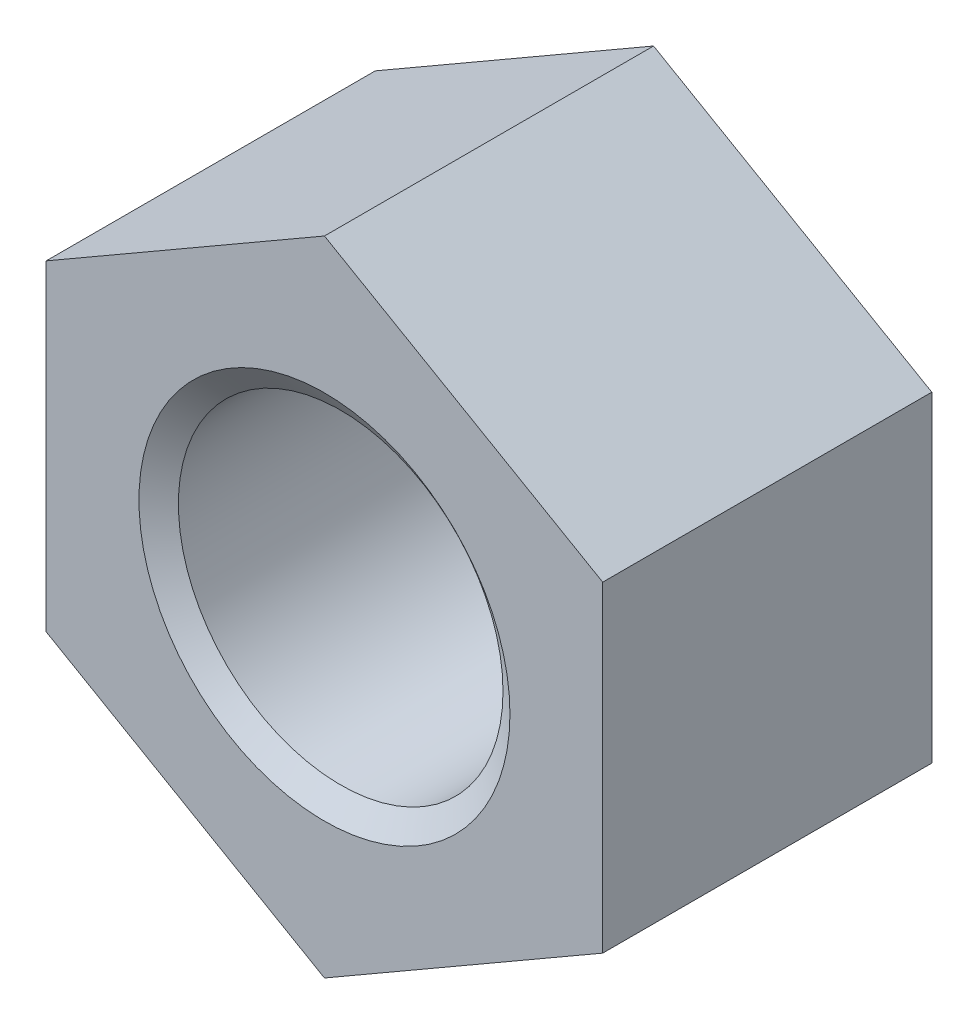
ISO-10303-21;
HEADER;
FILE_DESCRIPTION(('STEP AP214'),'2;1');
FILE_NAME('part.step','',(''),(''),'','','');
FILE_SCHEMA(('AUTOMOTIVE_DESIGN { 1 0 10303 214 1 1 1 1 }'));
ENDSEC;
DATA;
#1=APPLICATION_CONTEXT('core data for automotive mechanical design processes');
#2=APPLICATION_PROTOCOL_DEFINITION('international standard','automotive_design',2000,#1);
#3=PRODUCT_CONTEXT('',#1,'mechanical');
#4=PRODUCT('Part','Part','',(#3));
#5=PRODUCT_RELATED_PRODUCT_CATEGORY('part','',(#4));
#6=PRODUCT_DEFINITION_FORMATION('','',#4);
#7=PRODUCT_DEFINITION_CONTEXT('part definition',#1,'design');
#8=PRODUCT_DEFINITION('design','',#6,#7);
#9=PRODUCT_DEFINITION_SHAPE('','',#8);
#10=(LENGTH_UNIT() NAMED_UNIT(*) SI_UNIT(.MILLI.,.METRE.));
#11=(NAMED_UNIT(*) PLANE_ANGLE_UNIT() SI_UNIT($,.RADIAN.));
#12=(NAMED_UNIT(*) SI_UNIT($,.STERADIAN.) SOLID_ANGLE_UNIT());
#13=UNCERTAINTY_MEASURE_WITH_UNIT(LENGTH_MEASURE(1.E-05),#10,'distance_accuracy_value','');
#14=(GEOMETRIC_REPRESENTATION_CONTEXT(3) GLOBAL_UNCERTAINTY_ASSIGNED_CONTEXT((#13)) GLOBAL_UNIT_ASSIGNED_CONTEXT((#10,
#11,#12)) REPRESENTATION_CONTEXT('',''));
#15=CARTESIAN_POINT('',(0.,0.,0.));
#16=DIRECTION('',(0.,0.,1.));
#17=DIRECTION('',(1.,0.,0.));
#18=AXIS2_PLACEMENT_3D('',#15,#16,#17);
#19=CARTESIAN_POINT('',(0.,0.,-22.5298));
#20=DIRECTION('',(0.,0.,1.));
#21=DIRECTION('',(1.,0.,0.));
#22=AXIS2_PLACEMENT_3D('',#19,#20,#21);
#23=CYLINDRICAL_SURFACE('',#22,11.1125);
#24=CARTESIAN_POINT('',(0.,0.,-1.11157946690791));
#25=DIRECTION('',(0.,0.,1.));
#26=DIRECTION('',(1.,0.,0.));
#27=AXIS2_PLACEMENT_3D('',#24,#25,#26);
#28=CIRCLE('',#27,11.1125);
#29=CARTESIAN_POINT('',(11.1125,0.,-1.11157946690791));
#30=VERTEX_POINT('',#29);
#31=EDGE_CURVE('E125',#30,#30,#28,.F.);
#32=ORIENTED_EDGE('',*,*,#31,.F.);
#33=EDGE_LOOP('',(#32));
#34=FACE_BOUND('',#33,.T.);
#35=CARTESIAN_POINT('',(0.,0.,-21.3928205330921));
#36=DIRECTION('',(0.,0.,-1.));
#37=DIRECTION('',(-1.,0.,0.));
#38=AXIS2_PLACEMENT_3D('',#35,#36,#37);
#39=CIRCLE('',#38,11.1125);
#40=CARTESIAN_POINT('',(-11.1125,0.,-21.3928205330921));
#41=VERTEX_POINT('',#40);
#42=EDGE_CURVE('E38',#41,#41,#39,.F.);
#43=ORIENTED_EDGE('',*,*,#42,.F.);
#44=EDGE_LOOP('',(#43));
#45=FACE_BOUND('',#44,.T.);
#46=ADVANCED_FACE('F34',(#34,#45),#23,.F.);
#47=CARTESIAN_POINT('',(0.,21.9970452561247,-22.5298));
#48=DIRECTION('',(-0.5,0.866025403784438,0.));
#49=DIRECTION('',(-0.866025403784438,-0.5,0.));
#50=AXIS2_PLACEMENT_3D('',#47,#48,#49);
#51=PLANE('',#50);
#52=DIRECTION('',(-0.866025403784438,-0.5,0.));
#53=VECTOR('',#52,1.);
#54=CARTESIAN_POINT('',(0.,21.9970452561247,0.));
#55=LINE('',#54,#53);
#56=CARTESIAN_POINT('',(0.,21.9970452561247,0.));
#57=VERTEX_POINT('',#56);
#58=CARTESIAN_POINT('',(-19.05,10.9985226280624,0.));
#59=VERTEX_POINT('',#58);
#60=EDGE_CURVE('E121',#57,#59,#55,.T.);
#61=ORIENTED_EDGE('',*,*,#60,.F.);
#62=DIRECTION('',(0.,0.,1.));
#63=VECTOR('',#62,1.);
#64=CARTESIAN_POINT('',(0.,21.9970452561247,-22.5298));
#65=LINE('',#64,#63);
#66=CARTESIAN_POINT('',(0.,21.9970452561247,-22.5298));
#67=VERTEX_POINT('',#66);
#68=EDGE_CURVE('E11',#67,#57,#65,.T.);
#69=ORIENTED_EDGE('',*,*,#68,.F.);
#70=DIRECTION('',(-0.866025403784438,-0.5,0.));
#71=VECTOR('',#70,1.);
#72=CARTESIAN_POINT('',(0.,21.9970452561247,-22.5298));
#73=LINE('',#72,#71);
#74=CARTESIAN_POINT('',(-19.05,10.9985226280624,-22.5298));
#75=VERTEX_POINT('',#74);
#76=EDGE_CURVE('E136',#67,#75,#73,.T.);
#77=ORIENTED_EDGE('',*,*,#76,.T.);
#78=DIRECTION('',(0.,0.,1.));
#79=VECTOR('',#78,1.);
#80=CARTESIAN_POINT('',(-19.05,10.9985226280624,-22.5298));
#81=LINE('',#80,#79);
#82=EDGE_CURVE('E85',#75,#59,#81,.T.);
#83=ORIENTED_EDGE('',*,*,#82,.T.);
#84=EDGE_LOOP('',(#61,#69,#77,#83));
#85=FACE_BOUND('',#84,.T.);
#86=ADVANCED_FACE('F36',(#85),#51,.T.);
#87=CARTESIAN_POINT('',(19.05,10.9985226280624,-22.5298));
#88=DIRECTION('',(0.500000000000001,0.866025403784438,0.));
#89=DIRECTION('',(-0.866025403784438,0.500000000000001,0.));
#90=AXIS2_PLACEMENT_3D('',#87,#88,#89);
#91=PLANE('',#90);
#92=DIRECTION('',(-0.866025403784438,0.500000000000001,0.));
#93=VECTOR('',#92,1.);
#94=CARTESIAN_POINT('',(19.05,10.9985226280624,0.));
#95=LINE('',#94,#93);
#96=CARTESIAN_POINT('',(19.05,10.9985226280624,0.));
#97=VERTEX_POINT('',#96);
#98=EDGE_CURVE('E134',#97,#57,#95,.T.);
#99=ORIENTED_EDGE('',*,*,#98,.F.);
#100=DIRECTION('',(0.,0.,1.));
#101=VECTOR('',#100,1.);
#102=CARTESIAN_POINT('',(19.05,10.9985226280624,-22.5298));
#103=LINE('',#102,#101);
#104=CARTESIAN_POINT('',(19.05,10.9985226280624,-22.5298));
#105=VERTEX_POINT('',#104);
#106=EDGE_CURVE('E44',#105,#97,#103,.T.);
#107=ORIENTED_EDGE('',*,*,#106,.F.);
#108=DIRECTION('',(-0.866025403784438,0.500000000000001,0.));
#109=VECTOR('',#108,1.);
#110=CARTESIAN_POINT('',(19.05,10.9985226280624,-22.5298));
#111=LINE('',#110,#109);
#112=EDGE_CURVE('E103',#105,#67,#111,.T.);
#113=ORIENTED_EDGE('',*,*,#112,.T.);
#114=ORIENTED_EDGE('',*,*,#68,.T.);
#115=EDGE_LOOP('',(#99,#107,#113,#114));
#116=FACE_BOUND('',#115,.T.);
#117=ADVANCED_FACE('F162',(#116),#91,.T.);
#118=CARTESIAN_POINT('',(19.05,10.9985226280624,-22.5298));
#119=DIRECTION('',(-1.,0.,0.));
#120=DIRECTION('',(0.,0.,1.));
#121=AXIS2_PLACEMENT_3D('',#118,#119,#120);
#122=PLANE('',#121);
#123=DIRECTION('',(0.,-1.,0.));
#124=VECTOR('',#123,1.);
#125=CARTESIAN_POINT('',(19.05,10.9985226280624,0.));
#126=LINE('',#125,#124);
#127=CARTESIAN_POINT('',(19.05,-10.9985226280624,0.));
#128=VERTEX_POINT('',#127);
#129=EDGE_CURVE('E107',#97,#128,#126,.T.);
#130=ORIENTED_EDGE('',*,*,#129,.T.);
#131=DIRECTION('',(0.,0.,1.));
#132=VECTOR('',#131,1.);
#133=CARTESIAN_POINT('',(19.05,-10.9985226280624,-22.5298));
#134=LINE('',#133,#132);
#135=CARTESIAN_POINT('',(19.05,-10.9985226280624,-22.5298));
#136=VERTEX_POINT('',#135);
#137=EDGE_CURVE('E105',#136,#128,#134,.T.);
#138=ORIENTED_EDGE('',*,*,#137,.F.);
#139=DIRECTION('',(0.,-1.,0.));
#140=VECTOR('',#139,1.);
#141=CARTESIAN_POINT('',(19.05,10.9985226280624,-22.5298));
#142=LINE('',#141,#140);
#143=EDGE_CURVE('E96',#105,#136,#142,.T.);
#144=ORIENTED_EDGE('',*,*,#143,.F.);
#145=ORIENTED_EDGE('',*,*,#106,.T.);
#146=EDGE_LOOP('',(#130,#138,#144,#145));
#147=FACE_BOUND('',#146,.T.);
#148=ADVANCED_FACE('F106',(#147),#122,.F.);
#149=CARTESIAN_POINT('',(0.,-21.9970452561248,-22.5298));
#150=DIRECTION('',(0.5,-0.866025403784438,0.));
#151=DIRECTION('',(0.866025403784439,0.5,0.));
#152=AXIS2_PLACEMENT_3D('',#149,#150,#151);
#153=PLANE('',#152);
#154=DIRECTION('',(0.866025403784439,0.5,0.));
#155=VECTOR('',#154,1.);
#156=CARTESIAN_POINT('',(0.,-21.9970452561248,0.));
#157=LINE('',#156,#155);
#158=CARTESIAN_POINT('',(0.,-21.9970452561248,0.));
#159=VERTEX_POINT('',#158);
#160=EDGE_CURVE('E131',#159,#128,#157,.T.);
#161=ORIENTED_EDGE('',*,*,#160,.F.);
#162=DIRECTION('',(0.,0.,1.));
#163=VECTOR('',#162,1.);
#164=CARTESIAN_POINT('',(0.,-21.9970452561248,-22.5298));
#165=LINE('',#164,#163);
#166=CARTESIAN_POINT('',(0.,-21.9970452561248,-22.5298));
#167=VERTEX_POINT('',#166);
#168=EDGE_CURVE('E111',#167,#159,#165,.T.);
#169=ORIENTED_EDGE('',*,*,#168,.F.);
#170=DIRECTION('',(0.866025403784439,0.5,0.));
#171=VECTOR('',#170,1.);
#172=CARTESIAN_POINT('',(0.,-21.9970452561248,-22.5298));
#173=LINE('',#172,#171);
#174=EDGE_CURVE('E101',#167,#136,#173,.T.);
#175=ORIENTED_EDGE('',*,*,#174,.T.);
#176=ORIENTED_EDGE('',*,*,#137,.T.);
#177=EDGE_LOOP('',(#161,#169,#175,#176));
#178=FACE_BOUND('',#177,.T.);
#179=ADVANCED_FACE('F113',(#178),#153,.T.);
#180=CARTESIAN_POINT('',(-19.05,-10.9985226280624,-22.5298));
#181=DIRECTION('',(-0.500000000000001,-0.866025403784438,0.));
#182=DIRECTION('',(0.866025403784438,-0.500000000000001,0.));
#183=AXIS2_PLACEMENT_3D('',#180,#181,#182);
#184=PLANE('',#183);
#185=DIRECTION('',(0.866025403784438,-0.500000000000001,0.));
#186=VECTOR('',#185,1.);
#187=CARTESIAN_POINT('',(-19.05,-10.9985226280624,0.));
#188=LINE('',#187,#186);
#189=CARTESIAN_POINT('',(-19.05,-10.9985226280624,0.));
#190=VERTEX_POINT('',#189);
#191=EDGE_CURVE('E128',#190,#159,#188,.T.);
#192=ORIENTED_EDGE('',*,*,#191,.F.);
#193=DIRECTION('',(0.,0.,1.));
#194=VECTOR('',#193,1.);
#195=CARTESIAN_POINT('',(-19.05,-10.9985226280624,-22.5298));
#196=LINE('',#195,#194);
#197=CARTESIAN_POINT('',(-19.05,-10.9985226280624,-22.5298));
#198=VERTEX_POINT('',#197);
#199=EDGE_CURVE('E140',#198,#190,#196,.T.);
#200=ORIENTED_EDGE('',*,*,#199,.F.);
#201=DIRECTION('',(0.866025403784438,-0.500000000000001,0.));
#202=VECTOR('',#201,1.);
#203=CARTESIAN_POINT('',(-19.05,-10.9985226280624,-22.5298));
#204=LINE('',#203,#202);
#205=EDGE_CURVE('E114',#198,#167,#204,.T.);
#206=ORIENTED_EDGE('',*,*,#205,.T.);
#207=ORIENTED_EDGE('',*,*,#168,.T.);
#208=EDGE_LOOP('',(#192,#200,#206,#207));
#209=FACE_BOUND('',#208,.T.);
#210=ADVANCED_FACE('F239',(#209),#184,.T.);
#211=CARTESIAN_POINT('',(-19.05,10.9985226280624,-22.5298));
#212=DIRECTION('',(-1.,0.,0.));
#213=DIRECTION('',(0.,-1.,0.));
#214=AXIS2_PLACEMENT_3D('',#211,#212,#213);
#215=PLANE('',#214);
#216=DIRECTION('',(0.,-1.,0.));
#217=VECTOR('',#216,1.);
#218=CARTESIAN_POINT('',(-19.05,10.9985226280624,0.));
#219=LINE('',#218,#217);
#220=EDGE_CURVE('E124',#59,#190,#219,.T.);
#221=ORIENTED_EDGE('',*,*,#220,.F.);
#222=ORIENTED_EDGE('',*,*,#82,.F.);
#223=DIRECTION('',(0.,-1.,0.));
#224=VECTOR('',#223,1.);
#225=CARTESIAN_POINT('',(-19.05,10.9985226280624,-22.5298));
#226=LINE('',#225,#224);
#227=EDGE_CURVE('E116',#75,#198,#226,.T.);
#228=ORIENTED_EDGE('',*,*,#227,.T.);
#229=ORIENTED_EDGE('',*,*,#199,.T.);
#230=EDGE_LOOP('',(#221,#222,#228,#229));
#231=FACE_BOUND('',#230,.T.);
#232=ADVANCED_FACE('F158',(#231),#215,.T.);
#233=CARTESIAN_POINT('',(-38.1,0.,-22.5298));
#234=DIRECTION('',(0.,0.,1.));
#235=DIRECTION('',(1.,0.,0.));
#236=AXIS2_PLACEMENT_3D('',#233,#234,#235);
#237=PLANE('',#236);
#238=CARTESIAN_POINT('',(0.,0.,-22.5298));
#239=DIRECTION('',(0.,0.,1.));
#240=DIRECTION('',(1.,0.,0.));
#241=AXIS2_PLACEMENT_3D('',#238,#239,#240);
#242=CIRCLE('',#241,12.7);
#243=CARTESIAN_POINT('',(12.7,0.,-22.5298));
#244=VERTEX_POINT('',#243);
#245=EDGE_CURVE('E145',#244,#244,#242,.F.);
#246=ORIENTED_EDGE('',*,*,#245,.F.);
#247=EDGE_LOOP('',(#246));
#248=FACE_BOUND('',#247,.T.);
#249=ORIENTED_EDGE('',*,*,#76,.F.);
#250=ORIENTED_EDGE('',*,*,#112,.F.);
#251=ORIENTED_EDGE('',*,*,#143,.T.);
#252=ORIENTED_EDGE('',*,*,#174,.F.);
#253=ORIENTED_EDGE('',*,*,#205,.F.);
#254=ORIENTED_EDGE('',*,*,#227,.F.);
#255=EDGE_LOOP('',(#249,#250,#251,#252,#253,#254));
#256=FACE_BOUND('',#255,.T.);
#257=ADVANCED_FACE('F98',(#248,#256),#237,.F.);
#258=CARTESIAN_POINT('',(-38.1,0.,0.));
#259=DIRECTION('',(0.,0.,1.));
#260=DIRECTION('',(1.,0.,0.));
#261=AXIS2_PLACEMENT_3D('',#258,#259,#260);
#262=PLANE('',#261);
#263=CARTESIAN_POINT('',(0.,0.,0.));
#264=DIRECTION('',(0.,0.,1.));
#265=DIRECTION('',(1.,0.,0.));
#266=AXIS2_PLACEMENT_3D('',#263,#264,#265);
#267=CIRCLE('',#266,12.7);
#268=CARTESIAN_POINT('',(12.7,0.,0.));
#269=VERTEX_POINT('',#268);
#270=EDGE_CURVE('E144',#269,#269,#267,.T.);
#271=ORIENTED_EDGE('',*,*,#270,.F.);
#272=EDGE_LOOP('',(#271));
#273=FACE_BOUND('',#272,.T.);
#274=ORIENTED_EDGE('',*,*,#60,.T.);
#275=ORIENTED_EDGE('',*,*,#220,.T.);
#276=ORIENTED_EDGE('',*,*,#191,.T.);
#277=ORIENTED_EDGE('',*,*,#160,.T.);
#278=ORIENTED_EDGE('',*,*,#129,.F.);
#279=ORIENTED_EDGE('',*,*,#98,.T.);
#280=EDGE_LOOP('',(#274,#275,#276,#277,#278,#279));
#281=FACE_BOUND('',#280,.T.);
#282=ADVANCED_FACE('F161',(#273,#281),#262,.T.);
#283=CARTESIAN_POINT('',(0.,0.,-1.2227374135987));
#284=DIRECTION('',(0.,0.,1.));
#285=DIRECTION('',(1.,0.,0.));
#286=AXIS2_PLACEMENT_3D('',#283,#284,#285);
#287=CONICAL_SURFACE('',#286,10.95375,0.959931088596884);
#288=ORIENTED_EDGE('',*,*,#270,.T.);
#289=EDGE_LOOP('',(#288));
#290=FACE_BOUND('',#289,.T.);
#291=ORIENTED_EDGE('',*,*,#31,.T.);
#292=EDGE_LOOP('',(#291));
#293=FACE_BOUND('',#292,.T.);
#294=ADVANCED_FACE('F180',(#290,#293),#287,.F.);
#295=CARTESIAN_POINT('',(0.,0.,-22.5044));
#296=DIRECTION('',(0.,0.,-1.));
#297=DIRECTION('',(-1.,0.,0.));
#298=AXIS2_PLACEMENT_3D('',#295,#296,#297);
#299=CONICAL_SURFACE('',#298,12.7,0.95993108859688);
#300=CARTESIAN_POINT('',(0.,0.,-22.5044));
#301=DIRECTION('',(0.,0.,1.));
#302=DIRECTION('',(1.,0.,0.));
#303=AXIS2_PLACEMENT_3D('',#300,#301,#302);
#304=CIRCLE('',#303,12.7);
#305=CARTESIAN_POINT('',(12.7,0.,-22.5044));
#306=VERTEX_POINT('',#305);
#307=EDGE_CURVE('E147',#306,#306,#304,.T.);
#308=ORIENTED_EDGE('',*,*,#307,.F.);
#309=EDGE_LOOP('',(#308));
#310=FACE_BOUND('',#309,.T.);
#311=ORIENTED_EDGE('',*,*,#42,.T.);
#312=EDGE_LOOP('',(#311));
#313=FACE_BOUND('',#312,.T.);
#314=ADVANCED_FACE('F189',(#310,#313),#299,.F.);
#315=CARTESIAN_POINT('',(0.,0.,-25.0375057290932));
#316=DIRECTION('',(0.,0.,1.));
#317=DIRECTION('',(1.,0.,0.));
#318=AXIS2_PLACEMENT_3D('',#315,#316,#317);
#319=CYLINDRICAL_SURFACE('',#318,12.7);
#320=ORIENTED_EDGE('',*,*,#307,.T.);
#321=EDGE_LOOP('',(#320));
#322=FACE_BOUND('',#321,.T.);
#323=ORIENTED_EDGE('',*,*,#245,.T.);
#324=EDGE_LOOP('',(#323));
#325=FACE_BOUND('',#324,.T.);
#326=ADVANCED_FACE('F196',(#322,#325),#319,.F.);
#327=CLOSED_SHELL('',(#46,#86,#117,#148,#179,#210,#232,#257,#282,#294,#314,#326));
#328=MANIFOLD_SOLID_BREP('B2',#327);
#329=ADVANCED_BREP_SHAPE_REPRESENTATION('',(#18,#328),#14);
#330=SHAPE_DEFINITION_REPRESENTATION(#9,#329);
ENDSEC;
END-ISO-10303-21;
